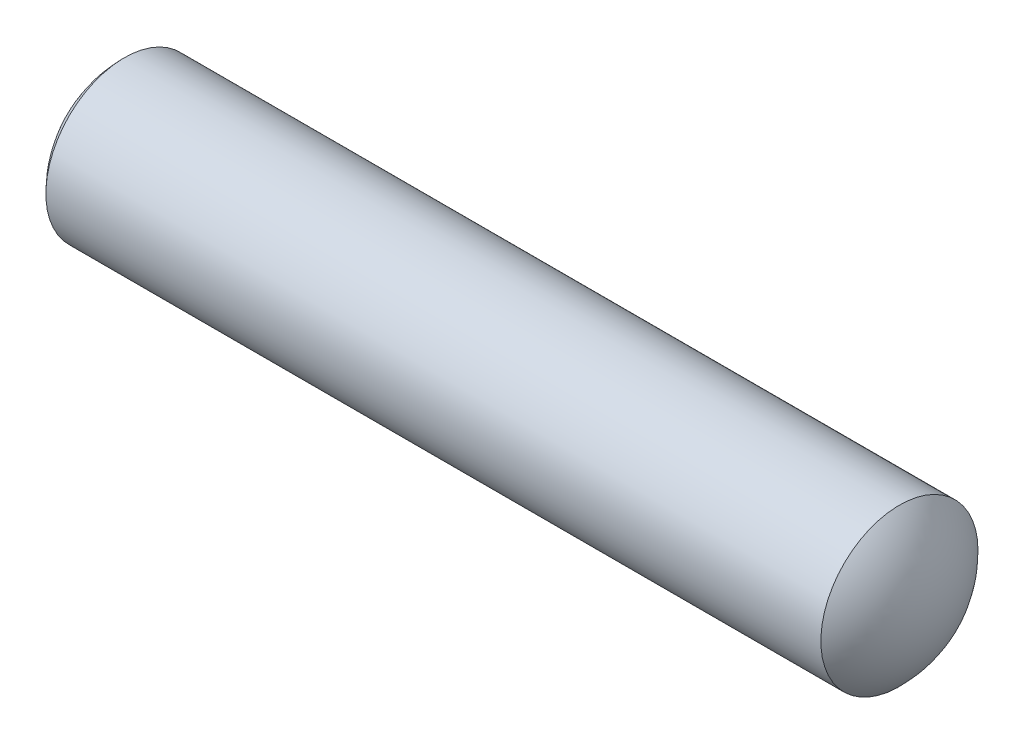
ISO-10303-21;
HEADER;
FILE_DESCRIPTION(('STEP AP214'),'2;1');
FILE_NAME('part.step','',(''),(''),'','','');
FILE_SCHEMA(('AUTOMOTIVE_DESIGN { 1 0 10303 214 1 1 1 1 }'));
ENDSEC;
DATA;
#1=APPLICATION_CONTEXT('core data for automotive mechanical design processes');
#2=APPLICATION_PROTOCOL_DEFINITION('international standard','automotive_design',2000,#1);
#3=PRODUCT_CONTEXT('',#1,'mechanical');
#4=PRODUCT('Part','Part','',(#3));
#5=PRODUCT_RELATED_PRODUCT_CATEGORY('part','',(#4));
#6=PRODUCT_DEFINITION_FORMATION('','',#4);
#7=PRODUCT_DEFINITION_CONTEXT('part definition',#1,'design');
#8=PRODUCT_DEFINITION('design','',#6,#7);
#9=PRODUCT_DEFINITION_SHAPE('','',#8);
#10=(LENGTH_UNIT() NAMED_UNIT(*) SI_UNIT(.MILLI.,.METRE.));
#11=(NAMED_UNIT(*) PLANE_ANGLE_UNIT() SI_UNIT($,.RADIAN.));
#12=(NAMED_UNIT(*) SI_UNIT($,.STERADIAN.) SOLID_ANGLE_UNIT());
#13=UNCERTAINTY_MEASURE_WITH_UNIT(LENGTH_MEASURE(1.E-05),#10,'distance_accuracy_value','');
#14=(GEOMETRIC_REPRESENTATION_CONTEXT(3) GLOBAL_UNCERTAINTY_ASSIGNED_CONTEXT((#13)) GLOBAL_UNIT_ASSIGNED_CONTEXT((#10,
#11,#12)) REPRESENTATION_CONTEXT('',''));
#15=CARTESIAN_POINT('',(0.,0.,0.));
#16=DIRECTION('',(0.,0.,1.));
#17=DIRECTION('',(1.,0.,0.));
#18=AXIS2_PLACEMENT_3D('',#15,#16,#17);
#19=CARTESIAN_POINT('',(15.1875,-8.8535324646027,-19.3865319009932));
#20=DIRECTION('',(0.,0.909631995354518,-0.415415013001887));
#21=DIRECTION('',(1.,0.,0.));
#22=AXIS2_PLACEMENT_3D('',#19,#20,#21);
#23=SPHERICAL_SURFACE('',#22,1.8375);
#24=CARTESIAN_POINT('',(15.1875,-8.8535324646027,-19.3865319009932));
#25=DIRECTION('',(-1.,0.,0.));
#26=DIRECTION('',(0.,0.415415013001886,0.909631995354519));
#27=AXIS2_PLACEMENT_3D('',#24,#25,#26);
#28=SPHERICAL_SURFACE('',#27,1.8375);
#29=CARTESIAN_POINT('',(16.4734821149612,-8.8535324646027,-19.3865319009932));
#30=DIRECTION('',(-1.,0.,0.));
#31=DIRECTION('',(0.,0.415415013001886,0.909631995354519));
#32=AXIS2_PLACEMENT_3D('',#29,#30,#31);
#33=CIRCLE('',#32,1.3125);
#34=CARTESIAN_POINT('',(16.4734821149612,-8.30830026003773,-18.1926399070904));
#35=VERTEX_POINT('',#34);
#36=EDGE_CURVE('E11',#35,#35,#33,.T.);
#37=ORIENTED_EDGE('',*,*,#36,.F.);
#38=EDGE_LOOP('',(#37));
#39=FACE_BOUND('',#38,.T.);
#40=ADVANCED_FACE('F17',(#39),#28,.T.);
#41=CARTESIAN_POINT('',(10.,-8.8535324646027,-19.3865319009932));
#42=DIRECTION('',(-1.,0.,0.));
#43=DIRECTION('',(0.,0.415415013001886,0.909631995354519));
#44=AXIS2_PLACEMENT_3D('',#41,#42,#43);
#45=CYLINDRICAL_SURFACE('',#44,1.3125);
#46=CARTESIAN_POINT('',(3.52651788503884,-8.8535324646027,-19.3865319009932));
#47=DIRECTION('',(-1.,0.,0.));
#48=DIRECTION('',(0.,0.415415013001886,0.909631995354519));
#49=AXIS2_PLACEMENT_3D('',#46,#47,#48);
#50=CIRCLE('',#49,1.3125);
#51=CARTESIAN_POINT('',(3.52651788503884,-8.30830026003773,-18.1926399070904));
#52=VERTEX_POINT('',#51);
#53=EDGE_CURVE('E26',#52,#52,#50,.T.);
#54=ORIENTED_EDGE('',*,*,#53,.F.);
#55=EDGE_LOOP('',(#54));
#56=FACE_BOUND('',#55,.T.);
#57=ORIENTED_EDGE('',*,*,#36,.T.);
#58=EDGE_LOOP('',(#57));
#59=FACE_BOUND('',#58,.T.);
#60=ADVANCED_FACE('F19',(#56,#59),#45,.T.);
#61=CARTESIAN_POINT('',(4.8125,-8.8535324646027,-19.3865319009932));
#62=DIRECTION('',(0.,0.909631995354518,-0.415415013001887));
#63=DIRECTION('',(-1.,0.,0.));
#64=AXIS2_PLACEMENT_3D('',#61,#62,#63);
#65=SPHERICAL_SURFACE('',#64,1.8375);
#66=CARTESIAN_POINT('',(4.8125,-8.8535324646027,-19.3865319009932));
#67=DIRECTION('',(-1.,0.,0.));
#68=DIRECTION('',(0.,0.415415013001886,0.909631995354519));
#69=AXIS2_PLACEMENT_3D('',#66,#67,#68);
#70=SPHERICAL_SURFACE('',#69,1.8375);
#71=ORIENTED_EDGE('',*,*,#53,.T.);
#72=EDGE_LOOP('',(#71));
#73=FACE_BOUND('',#72,.T.);
#74=ADVANCED_FACE('F40',(#73),#70,.T.);
#75=CLOSED_SHELL('',(#40,#60,#74));
#76=MANIFOLD_SOLID_BREP('B1',#75);
#77=ADVANCED_BREP_SHAPE_REPRESENTATION('',(#18,#76),#14);
#78=SHAPE_DEFINITION_REPRESENTATION(#9,#77);
ENDSEC;
END-ISO-10303-21;
